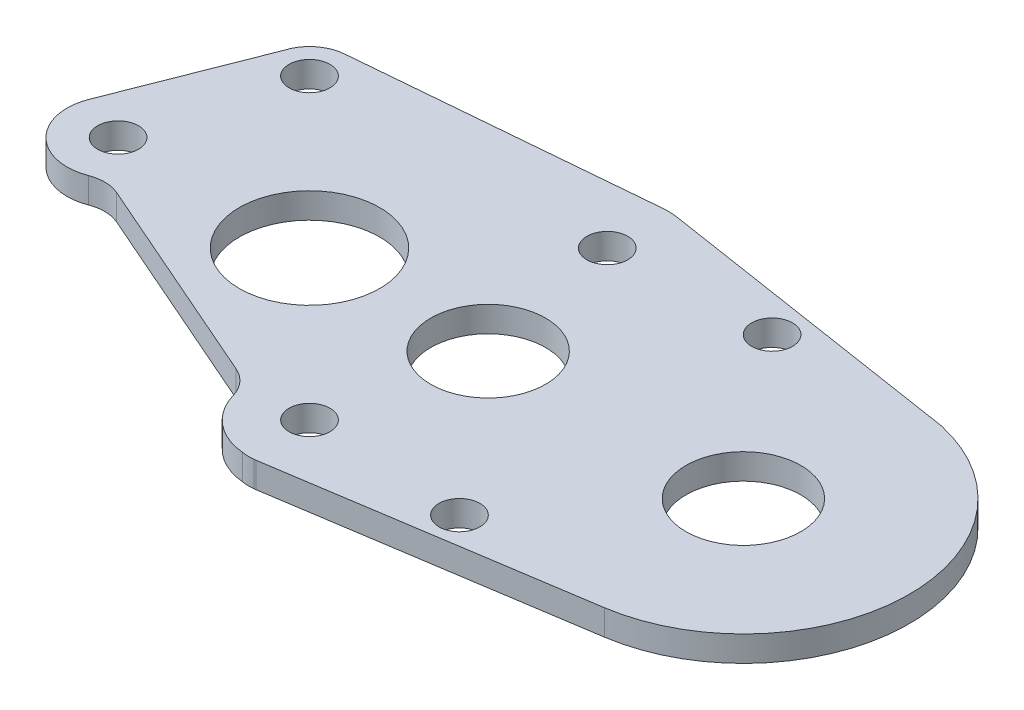
ISO-10303-21;
HEADER;
FILE_DESCRIPTION(('STEP AP214'),'2;1');
FILE_NAME('part.step','',(''),(''),'','','');
FILE_SCHEMA(('AUTOMOTIVE_DESIGN { 1 0 10303 214 1 1 1 1 }'));
ENDSEC;
DATA;
#1=APPLICATION_CONTEXT('core data for automotive mechanical design processes');
#2=APPLICATION_PROTOCOL_DEFINITION('international standard','automotive_design',2000,#1);
#3=PRODUCT_CONTEXT('',#1,'mechanical');
#4=PRODUCT('Part','Part','',(#3));
#5=PRODUCT_RELATED_PRODUCT_CATEGORY('part','',(#4));
#6=PRODUCT_DEFINITION_FORMATION('','',#4);
#7=PRODUCT_DEFINITION_CONTEXT('part definition',#1,'design');
#8=PRODUCT_DEFINITION('design','',#6,#7);
#9=PRODUCT_DEFINITION_SHAPE('','',#8);
#10=(LENGTH_UNIT() NAMED_UNIT(*) SI_UNIT(.MILLI.,.METRE.));
#11=(NAMED_UNIT(*) PLANE_ANGLE_UNIT() SI_UNIT($,.RADIAN.));
#12=(NAMED_UNIT(*) SI_UNIT($,.STERADIAN.) SOLID_ANGLE_UNIT());
#13=UNCERTAINTY_MEASURE_WITH_UNIT(LENGTH_MEASURE(1.E-05),#10,'distance_accuracy_value','');
#14=(GEOMETRIC_REPRESENTATION_CONTEXT(3) GLOBAL_UNCERTAINTY_ASSIGNED_CONTEXT((#13)) GLOBAL_UNIT_ASSIGNED_CONTEXT((#10,
#11,#12)) REPRESENTATION_CONTEXT('',''));
#15=CARTESIAN_POINT('',(0.,0.,0.));
#16=DIRECTION('',(0.,0.,1.));
#17=DIRECTION('',(1.,0.,0.));
#18=AXIS2_PLACEMENT_3D('',#15,#16,#17);
#19=CARTESIAN_POINT('',(-16.5706821786184,2.,-8.1416587481929));
#20=DIRECTION('',(0.897518431433756,0.,0.440976944110109));
#21=DIRECTION('',(0.440976944110109,0.,-0.897518431433756));
#22=AXIS2_PLACEMENT_3D('',#19,#20,#21);
#23=PLANE('',#22);
#24=DIRECTION('',(0.,-1.,0.));
#25=VECTOR('',#24,1.);
#26=CARTESIAN_POINT('',(-14.3371459223521,2.,-12.6875652497674));
#27=LINE('',#26,#25);
#28=CARTESIAN_POINT('',(-14.3371459223521,2.,-12.6875652497674));
#29=VERTEX_POINT('',#28);
#30=CARTESIAN_POINT('',(-14.3371459223521,0.,-12.6875652497674));
#31=VERTEX_POINT('',#30);
#32=EDGE_CURVE('E244',#29,#31,#27,.T.);
#33=ORIENTED_EDGE('',*,*,#32,.F.);
#34=DIRECTION('',(-0.440976944110109,0.,0.897518431433756));
#35=VECTOR('',#34,1.);
#36=CARTESIAN_POINT('',(-16.5706821786184,2.,-8.1416587481929));
#37=LINE('',#36,#35);
#38=CARTESIAN_POINT('',(-14.2449123319365,2.,-12.8752878699655));
#39=VERTEX_POINT('',#38);
#40=EDGE_CURVE('E305',#39,#29,#37,.T.);
#41=ORIENTED_EDGE('',*,*,#40,.F.);
#42=DIRECTION('',(0.,-1.,0.));
#43=VECTOR('',#42,1.);
#44=CARTESIAN_POINT('',(-14.2449123319365,2.,-12.8752878699655));
#45=LINE('',#44,#43);
#46=CARTESIAN_POINT('',(-14.2449123319365,0.,-12.8752878699655));
#47=VERTEX_POINT('',#46);
#48=EDGE_CURVE('E348',#39,#47,#45,.T.);
#49=ORIENTED_EDGE('',*,*,#48,.T.);
#50=DIRECTION('',(-0.440976944110109,0.,0.897518431433756));
#51=VECTOR('',#50,1.);
#52=CARTESIAN_POINT('',(-16.5706821786184,0.,-8.1416587481929));
#53=LINE('',#52,#51);
#54=EDGE_CURVE('E342',#47,#31,#53,.T.);
#55=ORIENTED_EDGE('',*,*,#54,.T.);
#56=EDGE_LOOP('',(#33,#41,#49,#55));
#57=FACE_BOUND('',#56,.T.);
#58=ADVANCED_FACE('F109',(#57),#23,.F.);
#59=CARTESIAN_POINT('',(11.5523490357999,2.,11.5522850981571));
#60=DIRECTION('',(0.,-1.,0.));
#61=DIRECTION('',(0.,0.,-1.));
#62=AXIS2_PLACEMENT_3D('',#59,#60,#61);
#63=CYLINDRICAL_SURFACE('',#62,5.00000000000001);
#64=CARTESIAN_POINT('',(11.5523490357999,2.,11.5522850981571));
#65=DIRECTION('',(0.,1.,0.));
#66=DIRECTION('',(0.,0.,1.));
#67=AXIS2_PLACEMENT_3D('',#64,#65,#66);
#68=CIRCLE('',#67,5.00000000000001);
#69=CARTESIAN_POINT('',(12.1644030395949,2.,16.514682693719));
#70=VERTEX_POINT('',#69);
#71=CARTESIAN_POINT('',(12.3135895146823,2.,16.493996637018));
#72=VERTEX_POINT('',#71);
#73=EDGE_CURVE('E308',#70,#72,#68,.T.);
#74=ORIENTED_EDGE('',*,*,#73,.F.);
#75=DIRECTION('',(0.,-1.,0.));
#76=VECTOR('',#75,1.);
#77=CARTESIAN_POINT('',(12.1644030395949,2.,16.514682693719));
#78=LINE('',#77,#76);
#79=CARTESIAN_POINT('',(12.1644030395949,0.,16.514682693719));
#80=VERTEX_POINT('',#79);
#81=EDGE_CURVE('E230',#70,#80,#78,.T.);
#82=ORIENTED_EDGE('',*,*,#81,.T.);
#83=CARTESIAN_POINT('',(11.5523490357999,0.,11.5522850981571));
#84=DIRECTION('',(0.,1.,0.));
#85=DIRECTION('',(0.,0.,1.));
#86=AXIS2_PLACEMENT_3D('',#83,#84,#85);
#87=CIRCLE('',#86,5.00000000000001);
#88=CARTESIAN_POINT('',(12.3135895146823,0.,16.493996637018));
#89=VERTEX_POINT('',#88);
#90=EDGE_CURVE('E278',#80,#89,#87,.T.);
#91=ORIENTED_EDGE('',*,*,#90,.T.);
#92=DIRECTION('',(0.,-1.,0.));
#93=VECTOR('',#92,1.);
#94=CARTESIAN_POINT('',(12.3135895146823,2.,16.493996637018));
#95=LINE('',#94,#93);
#96=EDGE_CURVE('E310',#72,#89,#95,.T.);
#97=ORIENTED_EDGE('',*,*,#96,.F.);
#98=EDGE_LOOP('',(#74,#82,#91,#97));
#99=FACE_BOUND('',#98,.T.);
#100=ADVANCED_FACE('F447',(#99),#63,.T.);
#101=CARTESIAN_POINT('',(0.,2.,0.));
#102=DIRECTION('',(0.,1.,0.));
#103=DIRECTION('',(0.,0.,1.));
#104=AXIS2_PLACEMENT_3D('',#101,#102,#103);
#105=PLANE('',#104);
#106=CARTESIAN_POINT('',(11.667261889578,2.,11.667261889578));
#107=DIRECTION('',(0.,1.,0.));
#108=DIRECTION('',(0.,0.,1.));
#109=AXIS2_PLACEMENT_3D('',#106,#107,#108);
#110=CIRCLE('',#109,4.83744346666806);
#111=CARTESIAN_POINT('',(7.01744839027554,2.,13.0014634166772));
#112=VERTEX_POINT('',#111);
#113=CARTESIAN_POINT('',(11.2475088443028,2.,16.4864596105884));
#114=VERTEX_POINT('',#113);
#115=EDGE_CURVE('E235',#112,#114,#110,.T.);
#116=ORIENTED_EDGE('',*,*,#115,.T.);
#117=CARTESIAN_POINT('',(11.7971706373179,2.,13.5372441363819));
#118=DIRECTION('',(0.,1.,0.));
#119=DIRECTION('',(0.,0.,1.));
#120=AXIS2_PLACEMENT_3D('',#117,#118,#119);
#121=CIRCLE('',#120,3.);
#122=EDGE_CURVE('E224',#114,#70,#121,.T.);
#123=ORIENTED_EDGE('',*,*,#122,.T.);
#124=ORIENTED_EDGE('',*,*,#73,.T.);
#125=DIRECTION('',(-0.988342307772177,0.,0.152248095776488));
#126=VECTOR('',#125,1.);
#127=CARTESIAN_POINT('',(2.76732765579161,2.,17.9645399683825));
#128=LINE('',#127,#126);
#129=CARTESIAN_POINT('',(35.9792252450943,2.,12.8484500010383));
#130=VERTEX_POINT('',#129);
#131=EDGE_CURVE('E287',#130,#72,#128,.T.);
#132=ORIENTED_EDGE('',*,*,#131,.F.);
#133=CARTESIAN_POINT('',(34.,2.,0.));
#134=DIRECTION('',(0.,1.,0.));
#135=DIRECTION('',(0.,0.,1.));
#136=AXIS2_PLACEMENT_3D('',#133,#134,#135);
#137=CIRCLE('',#136,13.);
#138=CARTESIAN_POINT('',(36.8136480405111,2.,-12.6918629327663));
#139=VERTEX_POINT('',#138);
#140=EDGE_CURVE('E290',#130,#139,#137,.T.);
#141=ORIENTED_EDGE('',*,*,#140,.T.);
#142=DIRECTION('',(-0.988172221588201,0.,-0.153348167519012));
#143=VECTOR('',#142,1.);
#144=CARTESIAN_POINT('',(2.78895107485444,2.,-17.9719394377376));
#145=LINE('',#144,#143);
#146=CARTESIAN_POINT('',(12.3190673039404,2.,-16.4930212612838));
#147=VERTEX_POINT('',#146);
#148=EDGE_CURVE('E293',#139,#147,#145,.T.);
#149=ORIENTED_EDGE('',*,*,#148,.T.);
#150=CARTESIAN_POINT('',(11.5523264663453,2.,-11.5521601533428));
#151=DIRECTION('',(0.,1.,0.));
#152=DIRECTION('',(0.,0.,1.));
#153=AXIS2_PLACEMENT_3D('',#150,#151,#152);
#154=CIRCLE('',#153,5.);
#155=CARTESIAN_POINT('',(11.1195562329338,2.,-16.5333959362658));
#156=VERTEX_POINT('',#155);
#157=EDGE_CURVE('E296',#147,#156,#154,.T.);
#158=ORIENTED_EDGE('',*,*,#157,.T.);
#159=DIRECTION('',(-0.996247156584608,0.,0.0865540466823088));
#160=VECTOR('',#159,1.);
#161=CARTESIAN_POINT('',(-1.34235858265061,2.,-15.4507036047797));
#162=LINE('',#161,#160);
#163=CARTESIAN_POINT('',(-11.8120191776821,2.,-14.541098507389));
#164=VERTEX_POINT('',#163);
#165=EDGE_CURVE('E299',#156,#164,#162,.T.);
#166=ORIENTED_EDGE('',*,*,#165,.T.);
#167=CARTESIAN_POINT('',(-11.5523570376352,2.,-11.5523570376352));
#168=DIRECTION('',(0.,1.,0.));
#169=DIRECTION('',(0.,0.,1.));
#170=AXIS2_PLACEMENT_3D('',#167,#168,#169);
#171=CIRCLE('',#170,3.);
#172=EDGE_CURVE('E302',#164,#39,#171,.T.);
#173=ORIENTED_EDGE('',*,*,#172,.T.);
#174=ORIENTED_EDGE('',*,*,#40,.T.);
#175=DIRECTION('',(0.862441888219209,0.,-0.506156091976463));
#176=VECTOR('',#175,1.);
#177=CARTESIAN_POINT('',(-31.0331302901297,2.,-2.88890598387326));
#178=LINE('',#177,#176);
#179=CARTESIAN_POINT('',(-14.3084162071023,2.,-12.7044263514753));
#180=VERTEX_POINT('',#179);
#181=EDGE_CURVE('E240',#29,#180,#178,.T.);
#182=ORIENTED_EDGE('',*,*,#181,.T.);
#183=DIRECTION('',(-0.365520515206091,0.,0.930803283709009));
#184=VECTOR('',#183,1.);
#185=CARTESIAN_POINT('',(-14.3084162071023,2.,-12.7044263514753));
#186=LINE('',#185,#184);
#187=CARTESIAN_POINT('',(-18.723213134836,2.,-1.46208206082441));
#188=VERTEX_POINT('',#187);
#189=EDGE_CURVE('E419',#180,#188,#186,.T.);
#190=ORIENTED_EDGE('',*,*,#189,.T.);
#191=CARTESIAN_POINT('',(-15.,2.,0.));
#192=DIRECTION('',(0.,1.,0.));
#193=DIRECTION('',(0.,0.,1.));
#194=AXIS2_PLACEMENT_3D('',#191,#192,#193);
#195=CIRCLE('',#194,4.);
#196=CARTESIAN_POINT('',(-13.5805297979219,2.,3.73966634145506));
#197=VERTEX_POINT('',#196);
#198=EDGE_CURVE('E398',#188,#197,#195,.T.);
#199=ORIENTED_EDGE('',*,*,#198,.T.);
#200=CARTESIAN_POINT('',(-12.5159271463633,2.,6.5444160975464));
#201=DIRECTION('',(0.,1.,0.));
#202=DIRECTION('',(0.,0.,1.));
#203=AXIS2_PLACEMENT_3D('',#200,#201,#202);
#204=CIRCLE('',#203,3.);
#205=CARTESIAN_POINT('',(-11.3134416807282,2.,3.79595676458614));
#206=VERTEX_POINT('',#205);
#207=EDGE_CURVE('E117',#197,#206,#204,.F.);
#208=ORIENTED_EDGE('',*,*,#207,.T.);
#209=DIRECTION('',(0.916153110986752,0.,0.400828488545034));
#210=VECTOR('',#209,1.);
#211=CARTESIAN_POINT('',(-3.2116091355295,2.,7.34061022326322));
#212=LINE('',#211,#210);
#213=CARTESIAN_POINT('',(5.3362948854452,2.,11.0804255531103));
#214=VERTEX_POINT('',#213);
#215=EDGE_CURVE('E395',#206,#214,#212,.T.);
#216=ORIENTED_EDGE('',*,*,#215,.T.);
#217=CARTESIAN_POINT('',(4.13380941981009,2.,13.8288848860705));
#218=DIRECTION('',(0.,1.,0.));
#219=DIRECTION('',(0.,0.,1.));
#220=AXIS2_PLACEMENT_3D('',#217,#218,#219);
#221=CIRCLE('',#220,3.);
#222=EDGE_CURVE('E239',#214,#112,#221,.F.);
#223=ORIENTED_EDGE('',*,*,#222,.T.);
#224=EDGE_LOOP('',(#116,#123,#124,#132,#141,#149,#158,#166,#173,#174,#182,#190,#199,#208,#216,#223));
#225=FACE_BOUND('',#224,.T.);
#226=CARTESIAN_POINT('',(24.,2.,-12.25));
#227=DIRECTION('',(0.,1.,0.));
#228=DIRECTION('',(0.,0.,1.));
#229=AXIS2_PLACEMENT_3D('',#226,#227,#228);
#230=CIRCLE('',#229,1.6);
#231=CARTESIAN_POINT('',(24.,2.,-10.65));
#232=VERTEX_POINT('',#231);
#233=EDGE_CURVE('E253',#232,#232,#230,.T.);
#234=ORIENTED_EDGE('',*,*,#233,.F.);
#235=EDGE_LOOP('',(#234));
#236=FACE_BOUND('',#235,.T.);
#237=CARTESIAN_POINT('',(24.,2.,12.25));
#238=DIRECTION('',(0.,1.,0.));
#239=DIRECTION('',(0.,0.,1.));
#240=AXIS2_PLACEMENT_3D('',#237,#238,#239);
#241=CIRCLE('',#240,1.6);
#242=CARTESIAN_POINT('',(24.,2.,13.85));
#243=VERTEX_POINT('',#242);
#244=EDGE_CURVE('E247',#243,#243,#241,.T.);
#245=ORIENTED_EDGE('',*,*,#244,.F.);
#246=EDGE_LOOP('',(#245));
#247=FACE_BOUND('',#246,.T.);
#248=CARTESIAN_POINT('',(-11.667261889578,2.,-11.667261889578));
#249=DIRECTION('',(0.,1.,0.));
#250=DIRECTION('',(0.,0.,1.));
#251=AXIS2_PLACEMENT_3D('',#248,#249,#250);
#252=CIRCLE('',#251,1.6);
#253=CARTESIAN_POINT('',(-11.667261889578,2.,-10.067261889578));
#254=VERTEX_POINT('',#253);
#255=EDGE_CURVE('E265',#254,#254,#252,.T.);
#256=ORIENTED_EDGE('',*,*,#255,.F.);
#257=EDGE_LOOP('',(#256));
#258=FACE_BOUND('',#257,.T.);
#259=CARTESIAN_POINT('',(11.667261889578,2.,-11.667261889578));
#260=DIRECTION('',(0.,1.,0.));
#261=DIRECTION('',(0.,0.,1.));
#262=AXIS2_PLACEMENT_3D('',#259,#260,#261);
#263=CIRCLE('',#262,1.6);
#264=CARTESIAN_POINT('',(11.667261889578,2.,-10.067261889578));
#265=VERTEX_POINT('',#264);
#266=EDGE_CURVE('E269',#265,#265,#263,.T.);
#267=ORIENTED_EDGE('',*,*,#266,.F.);
#268=EDGE_LOOP('',(#267));
#269=FACE_BOUND('',#268,.T.);
#270=CARTESIAN_POINT('',(11.667261889578,2.,11.667261889578));
#271=DIRECTION('',(0.,1.,0.));
#272=DIRECTION('',(0.,0.,1.));
#273=AXIS2_PLACEMENT_3D('',#270,#271,#272);
#274=CIRCLE('',#273,1.6);
#275=CARTESIAN_POINT('',(11.667261889578,2.,13.267261889578));
#276=VERTEX_POINT('',#275);
#277=EDGE_CURVE('E264',#276,#276,#274,.T.);
#278=ORIENTED_EDGE('',*,*,#277,.F.);
#279=EDGE_LOOP('',(#278));
#280=FACE_BOUND('',#279,.T.);
#281=CARTESIAN_POINT('',(0.,2.,0.));
#282=DIRECTION('',(0.,1.,0.));
#283=DIRECTION('',(0.,0.,1.));
#284=AXIS2_PLACEMENT_3D('',#281,#282,#283);
#285=CIRCLE('',#284,5.5);
#286=CARTESIAN_POINT('',(0.,2.,5.5));
#287=VERTEX_POINT('',#286);
#288=EDGE_CURVE('E274',#287,#287,#285,.T.);
#289=ORIENTED_EDGE('',*,*,#288,.F.);
#290=EDGE_LOOP('',(#289));
#291=FACE_BOUND('',#290,.T.);
#292=CARTESIAN_POINT('',(-15.,2.,0.));
#293=DIRECTION('',(0.,1.,0.));
#294=DIRECTION('',(0.,0.,1.));
#295=AXIS2_PLACEMENT_3D('',#292,#293,#294);
#296=CIRCLE('',#295,1.6);
#297=CARTESIAN_POINT('',(-15.,2.,1.59999999999995));
#298=VERTEX_POINT('',#297);
#299=EDGE_CURVE('E277',#298,#298,#296,.T.);
#300=ORIENTED_EDGE('',*,*,#299,.F.);
#301=EDGE_LOOP('',(#300));
#302=FACE_BOUND('',#301,.T.);
#303=CARTESIAN_POINT('',(14.,2.,0.));
#304=DIRECTION('',(0.,1.,0.));
#305=DIRECTION('',(0.,0.,1.));
#306=AXIS2_PLACEMENT_3D('',#303,#304,#305);
#307=CIRCLE('',#306,4.5);
#308=CARTESIAN_POINT('',(14.,2.,4.5));
#309=VERTEX_POINT('',#308);
#310=EDGE_CURVE('E281',#309,#309,#307,.T.);
#311=ORIENTED_EDGE('',*,*,#310,.F.);
#312=EDGE_LOOP('',(#311));
#313=FACE_BOUND('',#312,.T.);
#314=CARTESIAN_POINT('',(34.,2.,0.));
#315=DIRECTION('',(0.,1.,0.));
#316=DIRECTION('',(0.,0.,1.));
#317=AXIS2_PLACEMENT_3D('',#314,#315,#316);
#318=CIRCLE('',#317,4.5);
#319=CARTESIAN_POINT('',(34.,2.,4.5));
#320=VERTEX_POINT('',#319);
#321=EDGE_CURVE('E284',#320,#320,#318,.T.);
#322=ORIENTED_EDGE('',*,*,#321,.F.);
#323=EDGE_LOOP('',(#322));
#324=FACE_BOUND('',#323,.T.);
#325=ADVANCED_FACE('F236',(#225,#236,#247,#258,#269,#280,#291,#302,#313,#324),#105,.T.);
#326=CARTESIAN_POINT('',(0.,0.,0.));
#327=DIRECTION('',(0.,1.,0.));
#328=DIRECTION('',(0.,0.,1.));
#329=AXIS2_PLACEMENT_3D('',#326,#327,#328);
#330=PLANE('',#329);
#331=ORIENTED_EDGE('',*,*,#90,.F.);
#332=CARTESIAN_POINT('',(11.7971706373179,0.,13.5372441363819));
#333=DIRECTION('',(0.,1.,0.));
#334=DIRECTION('',(0.,0.,1.));
#335=AXIS2_PLACEMENT_3D('',#332,#333,#334);
#336=CIRCLE('',#335,3.);
#337=CARTESIAN_POINT('',(11.2475088443028,0.,16.4864596105884));
#338=VERTEX_POINT('',#337);
#339=EDGE_CURVE('E380',#80,#338,#336,.F.);
#340=ORIENTED_EDGE('',*,*,#339,.T.);
#341=CARTESIAN_POINT('',(11.667261889578,0.,11.667261889578));
#342=DIRECTION('',(0.,1.,0.));
#343=DIRECTION('',(0.,0.,1.));
#344=AXIS2_PLACEMENT_3D('',#341,#342,#343);
#345=CIRCLE('',#344,4.83744346666806);
#346=CARTESIAN_POINT('',(7.01744839027554,0.,13.0014634166772));
#347=VERTEX_POINT('',#346);
#348=EDGE_CURVE('E233',#347,#338,#345,.T.);
#349=ORIENTED_EDGE('',*,*,#348,.F.);
#350=CARTESIAN_POINT('',(4.13380941981009,0.,13.8288848860705));
#351=DIRECTION('',(0.,1.,0.));
#352=DIRECTION('',(0.,0.,1.));
#353=AXIS2_PLACEMENT_3D('',#350,#351,#352);
#354=CIRCLE('',#353,3.);
#355=CARTESIAN_POINT('',(5.33629488544519,0.,11.0804255531103));
#356=VERTEX_POINT('',#355);
#357=EDGE_CURVE('E392',#347,#356,#354,.T.);
#358=ORIENTED_EDGE('',*,*,#357,.T.);
#359=DIRECTION('',(-0.916153110986752,0.,-0.400828488545034));
#360=VECTOR('',#359,1.);
#361=CARTESIAN_POINT('',(-3.2116091355295,0.,7.34061022326322));
#362=LINE('',#361,#360);
#363=CARTESIAN_POINT('',(-11.3134416807282,0.,3.79595676458615));
#364=VERTEX_POINT('',#363);
#365=EDGE_CURVE('E241',#356,#364,#362,.T.);
#366=ORIENTED_EDGE('',*,*,#365,.T.);
#367=CARTESIAN_POINT('',(-12.5159271463633,0.,6.5444160975464));
#368=DIRECTION('',(0.,1.,0.));
#369=DIRECTION('',(0.,0.,1.));
#370=AXIS2_PLACEMENT_3D('',#367,#368,#369);
#371=CIRCLE('',#370,3.);
#372=CARTESIAN_POINT('',(-13.5805297979219,0.,3.73966634145506));
#373=VERTEX_POINT('',#372);
#374=EDGE_CURVE('E12',#364,#373,#371,.T.);
#375=ORIENTED_EDGE('',*,*,#374,.T.);
#376=CARTESIAN_POINT('',(-15.,0.,0.));
#377=DIRECTION('',(0.,1.,0.));
#378=DIRECTION('',(0.,0.,1.));
#379=AXIS2_PLACEMENT_3D('',#376,#377,#378);
#380=CIRCLE('',#379,4.);
#381=CARTESIAN_POINT('',(-18.723213134836,0.,-1.46208206082441));
#382=VERTEX_POINT('',#381);
#383=EDGE_CURVE('E365',#382,#373,#380,.T.);
#384=ORIENTED_EDGE('',*,*,#383,.F.);
#385=DIRECTION('',(-0.365520515206091,0.,0.930803283709009));
#386=VECTOR('',#385,1.);
#387=CARTESIAN_POINT('',(-16.7191344292882,0.,-6.56549749807694));
#388=LINE('',#387,#386);
#389=CARTESIAN_POINT('',(-14.3084162071023,0.,-12.7044263514753));
#390=VERTEX_POINT('',#389);
#391=EDGE_CURVE('E374',#390,#382,#388,.T.);
#392=ORIENTED_EDGE('',*,*,#391,.F.);
#393=DIRECTION('',(0.862441888219209,0.,-0.506156091976463));
#394=VECTOR('',#393,1.);
#395=CARTESIAN_POINT('',(-9.2115962062622,0.,-15.6956846940629));
#396=LINE('',#395,#394);
#397=EDGE_CURVE('E376',#31,#390,#396,.T.);
#398=ORIENTED_EDGE('',*,*,#397,.F.);
#399=ORIENTED_EDGE('',*,*,#54,.F.);
#400=CARTESIAN_POINT('',(-11.5523570376352,0.,-11.5523570376352));
#401=DIRECTION('',(0.,1.,0.));
#402=DIRECTION('',(0.,0.,1.));
#403=AXIS2_PLACEMENT_3D('',#400,#401,#402);
#404=CIRCLE('',#403,3.);
#405=CARTESIAN_POINT('',(-11.8120191776821,0.,-14.541098507389));
#406=VERTEX_POINT('',#405);
#407=EDGE_CURVE('E339',#406,#47,#404,.T.);
#408=ORIENTED_EDGE('',*,*,#407,.F.);
#409=DIRECTION('',(-0.996247156584608,0.,0.0865540466823088));
#410=VECTOR('',#409,1.);
#411=CARTESIAN_POINT('',(-1.34235858265061,0.,-15.4507036047797));
#412=LINE('',#411,#410);
#413=CARTESIAN_POINT('',(11.1195562329338,0.,-16.5333959362658));
#414=VERTEX_POINT('',#413);
#415=EDGE_CURVE('E336',#414,#406,#412,.T.);
#416=ORIENTED_EDGE('',*,*,#415,.F.);
#417=CARTESIAN_POINT('',(11.5523264663453,0.,-11.5521601533428));
#418=DIRECTION('',(0.,1.,0.));
#419=DIRECTION('',(0.,0.,1.));
#420=AXIS2_PLACEMENT_3D('',#417,#418,#419);
#421=CIRCLE('',#420,5.);
#422=CARTESIAN_POINT('',(12.3190673039404,0.,-16.4930212612838));
#423=VERTEX_POINT('',#422);
#424=EDGE_CURVE('E333',#423,#414,#421,.T.);
#425=ORIENTED_EDGE('',*,*,#424,.F.);
#426=DIRECTION('',(-0.988172221588201,0.,-0.153348167519012));
#427=VECTOR('',#426,1.);
#428=CARTESIAN_POINT('',(2.78895107485444,0.,-17.9719394377376));
#429=LINE('',#428,#427);
#430=CARTESIAN_POINT('',(36.8136480405111,0.,-12.6918629327663));
#431=VERTEX_POINT('',#430);
#432=EDGE_CURVE('E330',#431,#423,#429,.T.);
#433=ORIENTED_EDGE('',*,*,#432,.F.);
#434=CARTESIAN_POINT('',(34.,0.,0.));
#435=DIRECTION('',(0.,1.,0.));
#436=DIRECTION('',(0.,0.,1.));
#437=AXIS2_PLACEMENT_3D('',#434,#435,#436);
#438=CIRCLE('',#437,13.);
#439=CARTESIAN_POINT('',(35.9792252450943,0.,12.8484500010383));
#440=VERTEX_POINT('',#439);
#441=EDGE_CURVE('E327',#440,#431,#438,.T.);
#442=ORIENTED_EDGE('',*,*,#441,.F.);
#443=DIRECTION('',(-0.988342307772177,0.,0.152248095776488));
#444=VECTOR('',#443,1.);
#445=CARTESIAN_POINT('',(2.76732765579161,0.,17.9645399683825));
#446=LINE('',#445,#444);
#447=EDGE_CURVE('E324',#440,#89,#446,.T.);
#448=ORIENTED_EDGE('',*,*,#447,.T.);
#449=EDGE_LOOP('',(#331,#340,#349,#358,#366,#375,#384,#392,#398,#399,#408,#416,#425,#433,#442,#448));
#450=FACE_BOUND('',#449,.T.);
#451=CARTESIAN_POINT('',(34.,0.,0.));
#452=DIRECTION('',(0.,1.,0.));
#453=DIRECTION('',(0.,0.,1.));
#454=AXIS2_PLACEMENT_3D('',#451,#452,#453);
#455=CIRCLE('',#454,4.5);
#456=CARTESIAN_POINT('',(34.,0.,4.5));
#457=VERTEX_POINT('',#456);
#458=EDGE_CURVE('E321',#457,#457,#455,.T.);
#459=ORIENTED_EDGE('',*,*,#458,.T.);
#460=EDGE_LOOP('',(#459));
#461=FACE_BOUND('',#460,.T.);
#462=CARTESIAN_POINT('',(14.,0.,0.));
#463=DIRECTION('',(0.,1.,0.));
#464=DIRECTION('',(0.,0.,1.));
#465=AXIS2_PLACEMENT_3D('',#462,#463,#464);
#466=CIRCLE('',#465,4.5);
#467=CARTESIAN_POINT('',(14.,0.,4.5));
#468=VERTEX_POINT('',#467);
#469=EDGE_CURVE('E318',#468,#468,#466,.T.);
#470=ORIENTED_EDGE('',*,*,#469,.T.);
#471=EDGE_LOOP('',(#470));
#472=FACE_BOUND('',#471,.T.);
#473=CARTESIAN_POINT('',(-15.,0.,0.));
#474=DIRECTION('',(0.,1.,0.));
#475=DIRECTION('',(0.,0.,1.));
#476=AXIS2_PLACEMENT_3D('',#473,#474,#475);
#477=CIRCLE('',#476,1.6);
#478=CARTESIAN_POINT('',(-15.,0.,1.59999999999995));
#479=VERTEX_POINT('',#478);
#480=EDGE_CURVE('E314',#479,#479,#477,.T.);
#481=ORIENTED_EDGE('',*,*,#480,.T.);
#482=EDGE_LOOP('',(#481));
#483=FACE_BOUND('',#482,.T.);
#484=CARTESIAN_POINT('',(0.,0.,0.));
#485=DIRECTION('',(0.,1.,0.));
#486=DIRECTION('',(0.,0.,1.));
#487=AXIS2_PLACEMENT_3D('',#484,#485,#486);
#488=CIRCLE('',#487,5.5);
#489=CARTESIAN_POINT('',(0.,0.,5.5));
#490=VERTEX_POINT('',#489);
#491=EDGE_CURVE('E311',#490,#490,#488,.T.);
#492=ORIENTED_EDGE('',*,*,#491,.T.);
#493=EDGE_LOOP('',(#492));
#494=FACE_BOUND('',#493,.T.);
#495=CARTESIAN_POINT('',(24.,0.,12.25));
#496=DIRECTION('',(0.,1.,0.));
#497=DIRECTION('',(0.,0.,1.));
#498=AXIS2_PLACEMENT_3D('',#495,#496,#497);
#499=CIRCLE('',#498,1.6);
#500=CARTESIAN_POINT('',(24.,0.,13.85));
#501=VERTEX_POINT('',#500);
#502=EDGE_CURVE('E261',#501,#501,#499,.T.);
#503=ORIENTED_EDGE('',*,*,#502,.T.);
#504=EDGE_LOOP('',(#503));
#505=FACE_BOUND('',#504,.T.);
#506=CARTESIAN_POINT('',(24.,0.,-12.25));
#507=DIRECTION('',(0.,1.,0.));
#508=DIRECTION('',(0.,0.,1.));
#509=AXIS2_PLACEMENT_3D('',#506,#507,#508);
#510=CIRCLE('',#509,1.6);
#511=CARTESIAN_POINT('',(24.,0.,-10.65));
#512=VERTEX_POINT('',#511);
#513=EDGE_CURVE('E256',#512,#512,#510,.T.);
#514=ORIENTED_EDGE('',*,*,#513,.T.);
#515=EDGE_LOOP('',(#514));
#516=FACE_BOUND('',#515,.T.);
#517=CARTESIAN_POINT('',(11.667261889578,0.,11.667261889578));
#518=DIRECTION('',(0.,1.,0.));
#519=DIRECTION('',(0.,0.,1.));
#520=AXIS2_PLACEMENT_3D('',#517,#518,#519);
#521=CIRCLE('',#520,1.6);
#522=CARTESIAN_POINT('',(11.667261889578,0.,13.267261889578));
#523=VERTEX_POINT('',#522);
#524=EDGE_CURVE('E268',#523,#523,#521,.T.);
#525=ORIENTED_EDGE('',*,*,#524,.T.);
#526=EDGE_LOOP('',(#525));
#527=FACE_BOUND('',#526,.T.);
#528=CARTESIAN_POINT('',(11.667261889578,0.,-11.667261889578));
#529=DIRECTION('',(0.,1.,0.));
#530=DIRECTION('',(0.,0.,1.));
#531=AXIS2_PLACEMENT_3D('',#528,#529,#530);
#532=CIRCLE('',#531,1.6);
#533=CARTESIAN_POINT('',(11.667261889578,0.,-10.067261889578));
#534=VERTEX_POINT('',#533);
#535=EDGE_CURVE('E368',#534,#534,#532,.T.);
#536=ORIENTED_EDGE('',*,*,#535,.T.);
#537=EDGE_LOOP('',(#536));
#538=FACE_BOUND('',#537,.T.);
#539=CARTESIAN_POINT('',(-11.667261889578,0.,-11.667261889578));
#540=DIRECTION('',(0.,1.,0.));
#541=DIRECTION('',(0.,0.,1.));
#542=AXIS2_PLACEMENT_3D('',#539,#540,#541);
#543=CIRCLE('',#542,1.6);
#544=CARTESIAN_POINT('',(-11.667261889578,0.,-10.067261889578));
#545=VERTEX_POINT('',#544);
#546=EDGE_CURVE('E315',#545,#545,#543,.T.);
#547=ORIENTED_EDGE('',*,*,#546,.T.);
#548=EDGE_LOOP('',(#547));
#549=FACE_BOUND('',#548,.T.);
#550=ADVANCED_FACE('F412',(#450,#461,#472,#483,#494,#505,#516,#527,#538,#549),#330,.F.);
#551=CARTESIAN_POINT('',(2.76732765579161,2.,17.9645399683825));
#552=DIRECTION('',(0.152248095776488,0.,0.988342307772177));
#553=DIRECTION('',(0.988342307772177,0.,-0.152248095776488));
#554=AXIS2_PLACEMENT_3D('',#551,#552,#553);
#555=PLANE('',#554);
#556=ORIENTED_EDGE('',*,*,#447,.F.);
#557=DIRECTION('',(0.,-1.,0.));
#558=VECTOR('',#557,1.);
#559=CARTESIAN_POINT('',(35.9792252450943,2.,12.8484500010383));
#560=LINE('',#559,#558);
#561=EDGE_CURVE('E363',#130,#440,#560,.T.);
#562=ORIENTED_EDGE('',*,*,#561,.F.);
#563=ORIENTED_EDGE('',*,*,#131,.T.);
#564=ORIENTED_EDGE('',*,*,#96,.T.);
#565=EDGE_LOOP('',(#556,#562,#563,#564));
#566=FACE_BOUND('',#565,.T.);
#567=ADVANCED_FACE('F442',(#566),#555,.T.);
#568=CARTESIAN_POINT('',(34.,2.,0.));
#569=DIRECTION('',(0.,-1.,0.));
#570=DIRECTION('',(0.,0.,-1.));
#571=AXIS2_PLACEMENT_3D('',#568,#569,#570);
#572=CYLINDRICAL_SURFACE('',#571,13.);
#573=ORIENTED_EDGE('',*,*,#441,.T.);
#574=DIRECTION('',(0.,-1.,0.));
#575=VECTOR('',#574,1.);
#576=CARTESIAN_POINT('',(36.8136480405111,2.,-12.6918629327663));
#577=LINE('',#576,#575);
#578=EDGE_CURVE('E360',#139,#431,#577,.T.);
#579=ORIENTED_EDGE('',*,*,#578,.F.);
#580=ORIENTED_EDGE('',*,*,#140,.F.);
#581=ORIENTED_EDGE('',*,*,#561,.T.);
#582=EDGE_LOOP('',(#573,#579,#580,#581));
#583=FACE_BOUND('',#582,.T.);
#584=ADVANCED_FACE('F474',(#583),#572,.T.);
#585=CARTESIAN_POINT('',(2.78895107485444,2.,-17.9719394377376));
#586=DIRECTION('',(-0.153348167519012,0.,0.988172221588201));
#587=DIRECTION('',(0.988172221588201,0.,0.153348167519012));
#588=AXIS2_PLACEMENT_3D('',#585,#586,#587);
#589=PLANE('',#588);
#590=ORIENTED_EDGE('',*,*,#432,.T.);
#591=DIRECTION('',(0.,-1.,0.));
#592=VECTOR('',#591,1.);
#593=CARTESIAN_POINT('',(12.3190673039404,2.,-16.4930212612838));
#594=LINE('',#593,#592);
#595=EDGE_CURVE('E357',#147,#423,#594,.T.);
#596=ORIENTED_EDGE('',*,*,#595,.F.);
#597=ORIENTED_EDGE('',*,*,#148,.F.);
#598=ORIENTED_EDGE('',*,*,#578,.T.);
#599=EDGE_LOOP('',(#590,#596,#597,#598));
#600=FACE_BOUND('',#599,.T.);
#601=ADVANCED_FACE('F436',(#600),#589,.F.);
#602=CARTESIAN_POINT('',(11.5523264663453,2.,-11.5521601533428));
#603=DIRECTION('',(0.,-1.,0.));
#604=DIRECTION('',(0.,0.,-1.));
#605=AXIS2_PLACEMENT_3D('',#602,#603,#604);
#606=CYLINDRICAL_SURFACE('',#605,5.);
#607=ORIENTED_EDGE('',*,*,#424,.T.);
#608=DIRECTION('',(0.,-1.,0.));
#609=VECTOR('',#608,1.);
#610=CARTESIAN_POINT('',(11.1195562329338,2.,-16.5333959362658));
#611=LINE('',#610,#609);
#612=EDGE_CURVE('E354',#156,#414,#611,.T.);
#613=ORIENTED_EDGE('',*,*,#612,.F.);
#614=ORIENTED_EDGE('',*,*,#157,.F.);
#615=ORIENTED_EDGE('',*,*,#595,.T.);
#616=EDGE_LOOP('',(#607,#613,#614,#615));
#617=FACE_BOUND('',#616,.T.);
#618=ADVANCED_FACE('F433',(#617),#606,.T.);
#619=CARTESIAN_POINT('',(-1.34235858265061,2.,-15.4507036047797));
#620=DIRECTION('',(0.0865540466823088,0.,0.996247156584608));
#621=DIRECTION('',(0.996247156584608,0.,-0.0865540466823088));
#622=AXIS2_PLACEMENT_3D('',#619,#620,#621);
#623=PLANE('',#622);
#624=ORIENTED_EDGE('',*,*,#415,.T.);
#625=DIRECTION('',(0.,-1.,0.));
#626=VECTOR('',#625,1.);
#627=CARTESIAN_POINT('',(-11.8120191776821,2.,-14.541098507389));
#628=LINE('',#627,#626);
#629=EDGE_CURVE('E351',#164,#406,#628,.T.);
#630=ORIENTED_EDGE('',*,*,#629,.F.);
#631=ORIENTED_EDGE('',*,*,#165,.F.);
#632=ORIENTED_EDGE('',*,*,#612,.T.);
#633=EDGE_LOOP('',(#624,#630,#631,#632));
#634=FACE_BOUND('',#633,.T.);
#635=ADVANCED_FACE('F431',(#634),#623,.F.);
#636=CARTESIAN_POINT('',(-11.5523570376352,2.,-11.5523570376352));
#637=DIRECTION('',(0.,-1.,0.));
#638=DIRECTION('',(0.,0.,-1.));
#639=AXIS2_PLACEMENT_3D('',#636,#637,#638);
#640=CYLINDRICAL_SURFACE('',#639,3.);
#641=ORIENTED_EDGE('',*,*,#407,.T.);
#642=ORIENTED_EDGE('',*,*,#48,.F.);
#643=ORIENTED_EDGE('',*,*,#172,.F.);
#644=ORIENTED_EDGE('',*,*,#629,.T.);
#645=EDGE_LOOP('',(#641,#642,#643,#644));
#646=FACE_BOUND('',#645,.T.);
#647=ADVANCED_FACE('F428',(#646),#640,.T.);
#648=CARTESIAN_POINT('',(34.,2.,0.));
#649=DIRECTION('',(0.,-1.,0.));
#650=DIRECTION('',(0.,0.,-1.));
#651=AXIS2_PLACEMENT_3D('',#648,#649,#650);
#652=CYLINDRICAL_SURFACE('',#651,4.5);
#653=ORIENTED_EDGE('',*,*,#321,.T.);
#654=EDGE_LOOP('',(#653));
#655=FACE_BOUND('',#654,.T.);
#656=ORIENTED_EDGE('',*,*,#458,.F.);
#657=EDGE_LOOP('',(#656));
#658=FACE_BOUND('',#657,.T.);
#659=ADVANCED_FACE('F467',(#655,#658),#652,.F.);
#660=CARTESIAN_POINT('',(14.,2.,0.));
#661=DIRECTION('',(0.,-1.,0.));
#662=DIRECTION('',(0.,0.,-1.));
#663=AXIS2_PLACEMENT_3D('',#660,#661,#662);
#664=CYLINDRICAL_SURFACE('',#663,4.5);
#665=ORIENTED_EDGE('',*,*,#310,.T.);
#666=EDGE_LOOP('',(#665));
#667=FACE_BOUND('',#666,.T.);
#668=ORIENTED_EDGE('',*,*,#469,.F.);
#669=EDGE_LOOP('',(#668));
#670=FACE_BOUND('',#669,.T.);
#671=ADVANCED_FACE('F481',(#667,#670),#664,.F.);
#672=CARTESIAN_POINT('',(-15.,2.,0.));
#673=DIRECTION('',(0.,-1.,0.));
#674=DIRECTION('',(0.,0.,-1.));
#675=AXIS2_PLACEMENT_3D('',#672,#673,#674);
#676=CYLINDRICAL_SURFACE('',#675,1.6);
#677=ORIENTED_EDGE('',*,*,#299,.T.);
#678=EDGE_LOOP('',(#677));
#679=FACE_BOUND('',#678,.T.);
#680=ORIENTED_EDGE('',*,*,#480,.F.);
#681=EDGE_LOOP('',(#680));
#682=FACE_BOUND('',#681,.T.);
#683=ADVANCED_FACE('F485',(#679,#682),#676,.F.);
#684=CARTESIAN_POINT('',(0.,2.,0.));
#685=DIRECTION('',(0.,-1.,0.));
#686=DIRECTION('',(0.,0.,-1.));
#687=AXIS2_PLACEMENT_3D('',#684,#685,#686);
#688=CYLINDRICAL_SURFACE('',#687,5.5);
#689=ORIENTED_EDGE('',*,*,#288,.T.);
#690=EDGE_LOOP('',(#689));
#691=FACE_BOUND('',#690,.T.);
#692=ORIENTED_EDGE('',*,*,#491,.F.);
#693=EDGE_LOOP('',(#692));
#694=FACE_BOUND('',#693,.T.);
#695=ADVANCED_FACE('F489',(#691,#694),#688,.F.);
#696=CARTESIAN_POINT('',(11.667261889578,-8.,11.667261889578));
#697=DIRECTION('',(0.,1.,0.));
#698=DIRECTION('',(0.,0.,1.));
#699=AXIS2_PLACEMENT_3D('',#696,#697,#698);
#700=CYLINDRICAL_SURFACE('',#699,1.6);
#701=ORIENTED_EDGE('',*,*,#277,.T.);
#702=EDGE_LOOP('',(#701));
#703=FACE_BOUND('',#702,.T.);
#704=ORIENTED_EDGE('',*,*,#524,.F.);
#705=EDGE_LOOP('',(#704));
#706=FACE_BOUND('',#705,.T.);
#707=ADVANCED_FACE('F492',(#703,#706),#700,.F.);
#708=CARTESIAN_POINT('',(11.667261889578,-8.,-11.667261889578));
#709=DIRECTION('',(0.,1.,0.));
#710=DIRECTION('',(0.,0.,1.));
#711=AXIS2_PLACEMENT_3D('',#708,#709,#710);
#712=CYLINDRICAL_SURFACE('',#711,1.6);
#713=ORIENTED_EDGE('',*,*,#266,.T.);
#714=EDGE_LOOP('',(#713));
#715=FACE_BOUND('',#714,.T.);
#716=ORIENTED_EDGE('',*,*,#535,.F.);
#717=EDGE_LOOP('',(#716));
#718=FACE_BOUND('',#717,.T.);
#719=ADVANCED_FACE('F497',(#715,#718),#712,.F.);
#720=CARTESIAN_POINT('',(-11.667261889578,-8.,-11.667261889578));
#721=DIRECTION('',(0.,1.,0.));
#722=DIRECTION('',(0.,0.,1.));
#723=AXIS2_PLACEMENT_3D('',#720,#721,#722);
#724=CYLINDRICAL_SURFACE('',#723,1.6);
#725=ORIENTED_EDGE('',*,*,#255,.T.);
#726=EDGE_LOOP('',(#725));
#727=FACE_BOUND('',#726,.T.);
#728=ORIENTED_EDGE('',*,*,#546,.F.);
#729=EDGE_LOOP('',(#728));
#730=FACE_BOUND('',#729,.T.);
#731=ADVANCED_FACE('F516',(#727,#730),#724,.F.);
#732=CARTESIAN_POINT('',(24.,-8.,-12.25));
#733=DIRECTION('',(0.,1.,0.));
#734=DIRECTION('',(0.,0.,1.));
#735=AXIS2_PLACEMENT_3D('',#732,#733,#734);
#736=CYLINDRICAL_SURFACE('',#735,1.6);
#737=ORIENTED_EDGE('',*,*,#513,.F.);
#738=EDGE_LOOP('',(#737));
#739=FACE_BOUND('',#738,.T.);
#740=ORIENTED_EDGE('',*,*,#233,.T.);
#741=EDGE_LOOP('',(#740));
#742=FACE_BOUND('',#741,.T.);
#743=ADVANCED_FACE('F518',(#739,#742),#736,.F.);
#744=CARTESIAN_POINT('',(24.,-8.,12.25));
#745=DIRECTION('',(0.,1.,0.));
#746=DIRECTION('',(0.,0.,1.));
#747=AXIS2_PLACEMENT_3D('',#744,#745,#746);
#748=CYLINDRICAL_SURFACE('',#747,1.6);
#749=ORIENTED_EDGE('',*,*,#502,.F.);
#750=EDGE_LOOP('',(#749));
#751=FACE_BOUND('',#750,.T.);
#752=ORIENTED_EDGE('',*,*,#244,.T.);
#753=EDGE_LOOP('',(#752));
#754=FACE_BOUND('',#753,.T.);
#755=ADVANCED_FACE('F525',(#751,#754),#748,.F.);
#756=CARTESIAN_POINT('',(11.667261889578,-8.,11.667261889578));
#757=DIRECTION('',(0.,1.,0.));
#758=DIRECTION('',(0.,0.,1.));
#759=AXIS2_PLACEMENT_3D('',#756,#757,#758);
#760=CYLINDRICAL_SURFACE('',#759,4.83744346666806);
#761=ORIENTED_EDGE('',*,*,#115,.F.);
#762=DIRECTION('',(0.,1.,0.));
#763=VECTOR('',#762,1.);
#764=CARTESIAN_POINT('',(7.01744839027554,-8.,13.0014634166772));
#765=LINE('',#764,#763);
#766=EDGE_CURVE('E124',#112,#347,#765,.F.);
#767=ORIENTED_EDGE('',*,*,#766,.T.);
#768=ORIENTED_EDGE('',*,*,#348,.T.);
#769=DIRECTION('',(0.,1.,0.));
#770=VECTOR('',#769,1.);
#771=CARTESIAN_POINT('',(11.2475088443028,-8.,16.4864596105884));
#772=LINE('',#771,#770);
#773=EDGE_CURVE('E229',#338,#114,#772,.T.);
#774=ORIENTED_EDGE('',*,*,#773,.T.);
#775=EDGE_LOOP('',(#761,#767,#768,#774));
#776=FACE_BOUND('',#775,.T.);
#777=ADVANCED_FACE('F243',(#776),#760,.T.);
#778=CARTESIAN_POINT('',(-31.0331302901297,-8.,-2.88890598387326));
#779=DIRECTION('',(0.506156091976463,0.,0.862441888219209));
#780=DIRECTION('',(0.862441888219209,0.,-0.506156091976463));
#781=AXIS2_PLACEMENT_3D('',#778,#779,#780);
#782=PLANE('',#781);
#783=ORIENTED_EDGE('',*,*,#32,.T.);
#784=ORIENTED_EDGE('',*,*,#397,.T.);
#785=DIRECTION('',(0.,1.,0.));
#786=VECTOR('',#785,1.);
#787=CARTESIAN_POINT('',(-14.3084162071023,-8.,-12.7044263514753));
#788=LINE('',#787,#786);
#789=EDGE_CURVE('E245',#390,#180,#788,.T.);
#790=ORIENTED_EDGE('',*,*,#789,.T.);
#791=ORIENTED_EDGE('',*,*,#181,.F.);
#792=EDGE_LOOP('',(#783,#784,#790,#791));
#793=FACE_BOUND('',#792,.T.);
#794=ADVANCED_FACE('F422',(#793),#782,.T.);
#795=CARTESIAN_POINT('',(-14.3084162071023,-8.,-12.7044263514753));
#796=DIRECTION('',(-0.930803283709009,0.,-0.365520515206091));
#797=DIRECTION('',(-0.365520515206091,0.,0.930803283709009));
#798=AXIS2_PLACEMENT_3D('',#795,#796,#797);
#799=PLANE('',#798);
#800=ORIENTED_EDGE('',*,*,#391,.T.);
#801=DIRECTION('',(0.,1.,0.));
#802=VECTOR('',#801,1.);
#803=CARTESIAN_POINT('',(-18.723213134836,-8.,-1.46208206082441));
#804=LINE('',#803,#802);
#805=EDGE_CURVE('E249',#382,#188,#804,.T.);
#806=ORIENTED_EDGE('',*,*,#805,.T.);
#807=ORIENTED_EDGE('',*,*,#189,.F.);
#808=ORIENTED_EDGE('',*,*,#789,.F.);
#809=EDGE_LOOP('',(#800,#806,#807,#808));
#810=FACE_BOUND('',#809,.T.);
#811=ADVANCED_FACE('F417',(#810),#799,.T.);
#812=CARTESIAN_POINT('',(-15.,-8.,0.));
#813=DIRECTION('',(0.,1.,0.));
#814=DIRECTION('',(0.,0.,1.));
#815=AXIS2_PLACEMENT_3D('',#812,#813,#814);
#816=CYLINDRICAL_SURFACE('',#815,4.);
#817=ORIENTED_EDGE('',*,*,#383,.T.);
#818=DIRECTION('',(0.,1.,0.));
#819=VECTOR('',#818,1.);
#820=CARTESIAN_POINT('',(-13.5805297979219,-8.,3.73966634145506));
#821=LINE('',#820,#819);
#822=EDGE_CURVE('E388',#373,#197,#821,.T.);
#823=ORIENTED_EDGE('',*,*,#822,.T.);
#824=ORIENTED_EDGE('',*,*,#198,.F.);
#825=ORIENTED_EDGE('',*,*,#805,.F.);
#826=EDGE_LOOP('',(#817,#823,#824,#825));
#827=FACE_BOUND('',#826,.T.);
#828=ADVANCED_FACE('F408',(#827),#816,.T.);
#829=CARTESIAN_POINT('',(-3.2116091355295,-73.8370116906796,7.34061022326322));
#830=DIRECTION('',(-0.400828488545034,0.,0.916153110986752));
#831=DIRECTION('',(0.916153110986752,0.,0.400828488545034));
#832=AXIS2_PLACEMENT_3D('',#829,#830,#831);
#833=PLANE('',#832);
#834=ORIENTED_EDGE('',*,*,#365,.F.);
#835=DIRECTION('',(0.,-1.,0.));
#836=VECTOR('',#835,1.);
#837=CARTESIAN_POINT('',(5.33629488544519,2.,11.0804255531103));
#838=LINE('',#837,#836);
#839=EDGE_CURVE('E384',#356,#214,#838,.F.);
#840=ORIENTED_EDGE('',*,*,#839,.T.);
#841=ORIENTED_EDGE('',*,*,#215,.F.);
#842=DIRECTION('',(0.,-1.,0.));
#843=VECTOR('',#842,1.);
#844=CARTESIAN_POINT('',(-11.3134416807282,0.,3.79595676458615));
#845=LINE('',#844,#843);
#846=EDGE_CURVE('E382',#206,#364,#845,.T.);
#847=ORIENTED_EDGE('',*,*,#846,.T.);
#848=EDGE_LOOP('',(#834,#840,#841,#847));
#849=FACE_BOUND('',#848,.T.);
#850=ADVANCED_FACE('F404',(#849),#833,.T.);
#851=CARTESIAN_POINT('',(11.7971706373179,2.,13.5372441363819));
#852=DIRECTION('',(0.,-1.,0.));
#853=DIRECTION('',(0.,0.,-1.));
#854=AXIS2_PLACEMENT_3D('',#851,#852,#853);
#855=CYLINDRICAL_SURFACE('',#854,3.);
#856=ORIENTED_EDGE('',*,*,#339,.F.);
#857=ORIENTED_EDGE('',*,*,#81,.F.);
#858=ORIENTED_EDGE('',*,*,#122,.F.);
#859=ORIENTED_EDGE('',*,*,#773,.F.);
#860=EDGE_LOOP('',(#856,#857,#858,#859));
#861=FACE_BOUND('',#860,.T.);
#862=ADVANCED_FACE('F227',(#861),#855,.T.);
#863=CARTESIAN_POINT('',(4.13380941981009,-8.,13.8288848860705));
#864=DIRECTION('',(0.,1.,0.));
#865=DIRECTION('',(0.,0.,1.));
#866=AXIS2_PLACEMENT_3D('',#863,#864,#865);
#867=CYLINDRICAL_SURFACE('',#866,3.);
#868=ORIENTED_EDGE('',*,*,#357,.F.);
#869=ORIENTED_EDGE('',*,*,#766,.F.);
#870=ORIENTED_EDGE('',*,*,#222,.F.);
#871=ORIENTED_EDGE('',*,*,#839,.F.);
#872=EDGE_LOOP('',(#868,#869,#870,#871));
#873=FACE_BOUND('',#872,.T.);
#874=ADVANCED_FACE('F450',(#873),#867,.F.);
#875=CARTESIAN_POINT('',(-12.5159271463633,-8.,6.5444160975464));
#876=DIRECTION('',(0.,1.,0.));
#877=DIRECTION('',(0.,0.,1.));
#878=AXIS2_PLACEMENT_3D('',#875,#876,#877);
#879=CYLINDRICAL_SURFACE('',#878,3.);
#880=ORIENTED_EDGE('',*,*,#374,.F.);
#881=ORIENTED_EDGE('',*,*,#846,.F.);
#882=ORIENTED_EDGE('',*,*,#207,.F.);
#883=ORIENTED_EDGE('',*,*,#822,.F.);
#884=EDGE_LOOP('',(#880,#881,#882,#883));
#885=FACE_BOUND('',#884,.T.);
#886=ADVANCED_FACE('F111',(#885),#879,.F.);
#887=CLOSED_SHELL('',(#58,#100,#325,#550,#567,#584,#601,#618,#635,#647,#659,#671,#683,#695,#707,
#719,#731,#743,#755,#777,#794,#811,#828,#850,#862,#874,#886));
#888=MANIFOLD_SOLID_BREP('B2',#887);
#889=ADVANCED_BREP_SHAPE_REPRESENTATION('',(#18,#888),#14);
#890=SHAPE_DEFINITION_REPRESENTATION(#9,#889);
ENDSEC;
END-ISO-10303-21;
